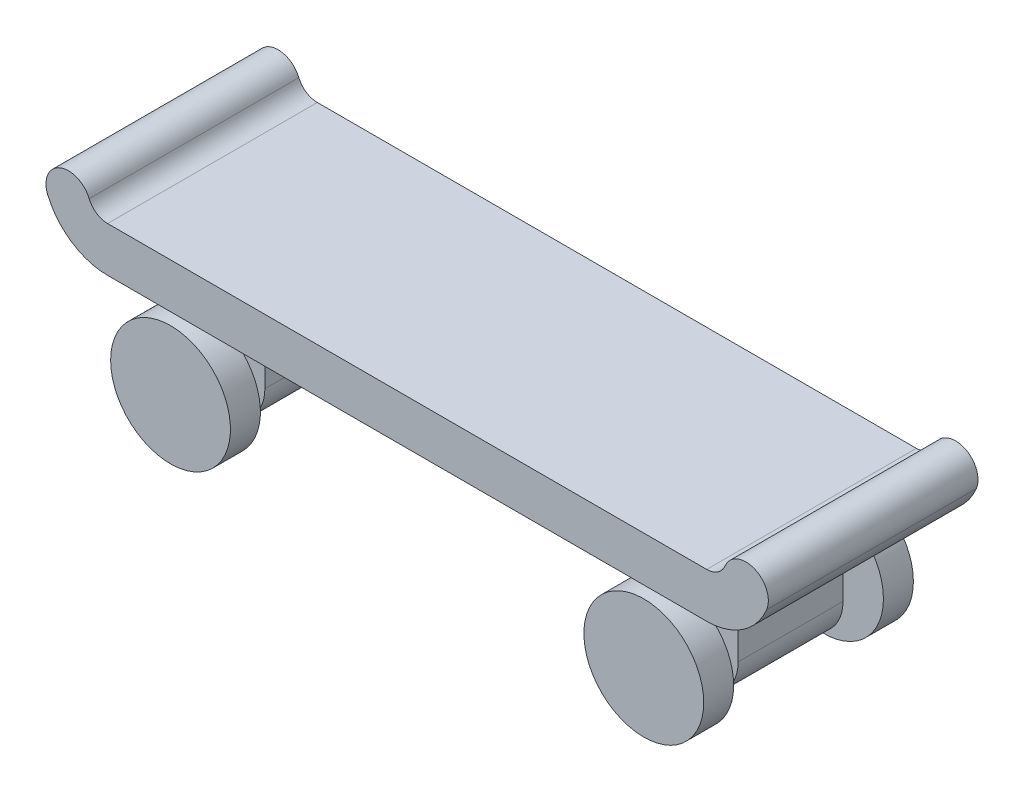
ISO-10303-21;
HEADER;
FILE_DESCRIPTION(('STEP AP214'),'2;1');
FILE_NAME('part.step','',(''),(''),'','','');
FILE_SCHEMA(('AUTOMOTIVE_DESIGN { 1 0 10303 214 1 1 1 1 }'));
ENDSEC;
DATA;
#1=APPLICATION_CONTEXT('core data for automotive mechanical design processes');
#2=APPLICATION_PROTOCOL_DEFINITION('international standard','automotive_design',2000,#1);
#3=PRODUCT_CONTEXT('',#1,'mechanical');
#4=PRODUCT('Part','Part','',(#3));
#5=PRODUCT_RELATED_PRODUCT_CATEGORY('part','',(#4));
#6=PRODUCT_DEFINITION_FORMATION('','',#4);
#7=PRODUCT_DEFINITION_CONTEXT('part definition',#1,'design');
#8=PRODUCT_DEFINITION('design','',#6,#7);
#9=PRODUCT_DEFINITION_SHAPE('','',#8);
#10=(LENGTH_UNIT() NAMED_UNIT(*) SI_UNIT(.MILLI.,.METRE.));
#11=(NAMED_UNIT(*) PLANE_ANGLE_UNIT() SI_UNIT($,.RADIAN.));
#12=(NAMED_UNIT(*) SI_UNIT($,.STERADIAN.) SOLID_ANGLE_UNIT());
#13=UNCERTAINTY_MEASURE_WITH_UNIT(LENGTH_MEASURE(1.E-05),#10,'distance_accuracy_value','');
#14=(GEOMETRIC_REPRESENTATION_CONTEXT(3) GLOBAL_UNCERTAINTY_ASSIGNED_CONTEXT((#13)) GLOBAL_UNIT_ASSIGNED_CONTEXT((#10,
#11,#12)) REPRESENTATION_CONTEXT('',''));
#15=CARTESIAN_POINT('',(0.,0.,0.));
#16=DIRECTION('',(0.,0.,1.));
#17=DIRECTION('',(1.,0.,0.));
#18=AXIS2_PLACEMENT_3D('',#15,#16,#17);
#19=CARTESIAN_POINT('',(-15.8,-4.8,5.));
#20=DIRECTION('',(0.,0.,-1.));
#21=DIRECTION('',(-1.,0.,0.));
#22=AXIS2_PLACEMENT_3D('',#19,#20,#21);
#23=CYLINDRICAL_SURFACE('',#22,1.15);
#24=CARTESIAN_POINT('',(-15.8,-4.8,5.));
#25=DIRECTION('',(0.,0.,1.));
#26=DIRECTION('',(-1.,0.,0.));
#27=AXIS2_PLACEMENT_3D('',#24,#25,#26);
#28=CIRCLE('',#27,1.15);
#29=CARTESIAN_POINT('',(-16.95,-4.8,5.));
#30=VERTEX_POINT('',#29);
#31=EDGE_CURVE('E11',#30,#30,#28,.T.);
#32=ORIENTED_EDGE('',*,*,#31,.F.);
#33=EDGE_LOOP('',(#32));
#34=FACE_BOUND('',#33,.T.);
#35=CARTESIAN_POINT('',(-15.8,-4.8,-5.));
#36=DIRECTION('',(0.,0.,1.));
#37=DIRECTION('',(-1.,0.,0.));
#38=AXIS2_PLACEMENT_3D('',#35,#36,#37);
#39=CIRCLE('',#38,1.15);
#40=CARTESIAN_POINT('',(-16.95,-4.8,-5.));
#41=VERTEX_POINT('',#40);
#42=EDGE_CURVE('E47',#41,#41,#39,.T.);
#43=ORIENTED_EDGE('',*,*,#42,.T.);
#44=EDGE_LOOP('',(#43));
#45=FACE_BOUND('',#44,.T.);
#46=ADVANCED_FACE('F44',(#34,#45),#23,.T.);
#47=CARTESIAN_POINT('',(-15.8,-4.8,7.));
#48=DIRECTION('',(0.,0.,-1.));
#49=DIRECTION('',(-1.,0.,0.));
#50=AXIS2_PLACEMENT_3D('',#47,#48,#49);
#51=CYLINDRICAL_SURFACE('',#50,4.);
#52=CARTESIAN_POINT('',(-15.8,-4.8,7.));
#53=DIRECTION('',(0.,0.,1.));
#54=DIRECTION('',(-1.,0.,0.));
#55=AXIS2_PLACEMENT_3D('',#52,#53,#54);
#56=CIRCLE('',#55,4.);
#57=CARTESIAN_POINT('',(-19.8,-4.8,7.));
#58=VERTEX_POINT('',#57);
#59=EDGE_CURVE('E51',#58,#58,#56,.T.);
#60=ORIENTED_EDGE('',*,*,#59,.F.);
#61=EDGE_LOOP('',(#60));
#62=FACE_BOUND('',#61,.T.);
#63=CARTESIAN_POINT('',(-15.8,-4.8,5.));
#64=DIRECTION('',(0.,0.,1.));
#65=DIRECTION('',(-1.,0.,0.));
#66=AXIS2_PLACEMENT_3D('',#63,#64,#65);
#67=CIRCLE('',#66,4.);
#68=CARTESIAN_POINT('',(-19.8,-4.8,5.));
#69=VERTEX_POINT('',#68);
#70=EDGE_CURVE('E55',#69,#69,#67,.T.);
#71=ORIENTED_EDGE('',*,*,#70,.T.);
#72=EDGE_LOOP('',(#71));
#73=FACE_BOUND('',#72,.T.);
#74=ADVANCED_FACE('F84',(#62,#73),#51,.T.);
#75=CARTESIAN_POINT('',(-15.8,-4.8,7.));
#76=DIRECTION('',(0.,0.,-1.));
#77=DIRECTION('',(-1.,0.,0.));
#78=AXIS2_PLACEMENT_3D('',#75,#76,#77);
#79=PLANE('',#78);
#80=ORIENTED_EDGE('',*,*,#59,.T.);
#81=EDGE_LOOP('',(#80));
#82=FACE_BOUND('',#81,.T.);
#83=ADVANCED_FACE('F89',(#82),#79,.F.);
#84=CARTESIAN_POINT('',(-15.8,-4.8,5.));
#85=DIRECTION('',(0.,0.,-1.));
#86=DIRECTION('',(-1.,0.,0.));
#87=AXIS2_PLACEMENT_3D('',#84,#85,#86);
#88=PLANE('',#87);
#89=ORIENTED_EDGE('',*,*,#31,.T.);
#90=EDGE_LOOP('',(#89));
#91=FACE_BOUND('',#90,.T.);
#92=ORIENTED_EDGE('',*,*,#70,.F.);
#93=EDGE_LOOP('',(#92));
#94=FACE_BOUND('',#93,.T.);
#95=ADVANCED_FACE('F80',(#91,#94),#88,.T.);
#96=CARTESIAN_POINT('',(-15.8,-4.8,-7.));
#97=DIRECTION('',(0.,0.,1.));
#98=DIRECTION('',(-1.,0.,0.));
#99=AXIS2_PLACEMENT_3D('',#96,#97,#98);
#100=PLANE('',#99);
#101=CARTESIAN_POINT('',(-15.8,-4.8,-7.));
#102=DIRECTION('',(0.,0.,1.));
#103=DIRECTION('',(-1.,0.,0.));
#104=AXIS2_PLACEMENT_3D('',#101,#102,#103);
#105=CIRCLE('',#104,4.);
#106=CARTESIAN_POINT('',(-19.8,-4.8,-7.));
#107=VERTEX_POINT('',#106);
#108=EDGE_CURVE('E60',#107,#107,#105,.T.);
#109=ORIENTED_EDGE('',*,*,#108,.F.);
#110=EDGE_LOOP('',(#109));
#111=FACE_BOUND('',#110,.T.);
#112=ADVANCED_FACE('F71',(#111),#100,.F.);
#113=CARTESIAN_POINT('',(-15.8,-4.8,-7.));
#114=DIRECTION('',(0.,0.,1.));
#115=DIRECTION('',(-1.,0.,0.));
#116=AXIS2_PLACEMENT_3D('',#113,#114,#115);
#117=CYLINDRICAL_SURFACE('',#116,4.);
#118=ORIENTED_EDGE('',*,*,#108,.T.);
#119=EDGE_LOOP('',(#118));
#120=FACE_BOUND('',#119,.T.);
#121=CARTESIAN_POINT('',(-15.8,-4.8,-5.));
#122=DIRECTION('',(0.,0.,1.));
#123=DIRECTION('',(-1.,0.,0.));
#124=AXIS2_PLACEMENT_3D('',#121,#122,#123);
#125=CIRCLE('',#124,4.);
#126=CARTESIAN_POINT('',(-19.8,-4.8,-5.));
#127=VERTEX_POINT('',#126);
#128=EDGE_CURVE('E63',#127,#127,#125,.T.);
#129=ORIENTED_EDGE('',*,*,#128,.F.);
#130=EDGE_LOOP('',(#129));
#131=FACE_BOUND('',#130,.T.);
#132=ADVANCED_FACE('F69',(#120,#131),#117,.T.);
#133=CARTESIAN_POINT('',(-15.8,-4.8,-5.));
#134=DIRECTION('',(0.,0.,1.));
#135=DIRECTION('',(-1.,0.,0.));
#136=AXIS2_PLACEMENT_3D('',#133,#134,#135);
#137=PLANE('',#136);
#138=ORIENTED_EDGE('',*,*,#42,.F.);
#139=EDGE_LOOP('',(#138));
#140=FACE_BOUND('',#139,.T.);
#141=ORIENTED_EDGE('',*,*,#128,.T.);
#142=EDGE_LOOP('',(#141));
#143=FACE_BOUND('',#142,.T.);
#144=ADVANCED_FACE('F67',(#140,#143),#137,.T.);
#145=CLOSED_SHELL('',(#46,#74,#83,#95,#112,#132,#144));
#146=MANIFOLD_SOLID_BREP('B2',#145);
#147=CARTESIAN_POINT('',(15.8,-4.8,5.));
#148=DIRECTION('',(0.,0.,-1.));
#149=DIRECTION('',(-1.,0.,0.));
#150=AXIS2_PLACEMENT_3D('',#147,#148,#149);
#151=CYLINDRICAL_SURFACE('',#150,1.15);
#152=CARTESIAN_POINT('',(15.8,-4.8,5.));
#153=DIRECTION('',(0.,0.,1.));
#154=DIRECTION('',(1.,0.,0.));
#155=AXIS2_PLACEMENT_3D('',#152,#153,#154);
#156=CIRCLE('',#155,1.15);
#157=CARTESIAN_POINT('',(16.95,-4.8,5.));
#158=VERTEX_POINT('',#157);
#159=EDGE_CURVE('E43',#158,#158,#156,.T.);
#160=ORIENTED_EDGE('',*,*,#159,.F.);
#161=EDGE_LOOP('',(#160));
#162=FACE_BOUND('',#161,.T.);
#163=CARTESIAN_POINT('',(15.8,-4.8,-5.));
#164=DIRECTION('',(0.,0.,1.));
#165=DIRECTION('',(1.,0.,0.));
#166=AXIS2_PLACEMENT_3D('',#163,#164,#165);
#167=CIRCLE('',#166,1.15);
#168=CARTESIAN_POINT('',(16.95,-4.8,-5.));
#169=VERTEX_POINT('',#168);
#170=EDGE_CURVE('E157',#169,#169,#167,.T.);
#171=ORIENTED_EDGE('',*,*,#170,.T.);
#172=EDGE_LOOP('',(#171));
#173=FACE_BOUND('',#172,.T.);
#174=ADVANCED_FACE('F154',(#162,#173),#151,.T.);
#175=CARTESIAN_POINT('',(15.8,-4.8,7.));
#176=DIRECTION('',(0.,0.,-1.));
#177=DIRECTION('',(-1.,0.,0.));
#178=AXIS2_PLACEMENT_3D('',#175,#176,#177);
#179=CYLINDRICAL_SURFACE('',#178,4.);
#180=CARTESIAN_POINT('',(15.8,-4.8,7.));
#181=DIRECTION('',(0.,0.,1.));
#182=DIRECTION('',(1.,0.,0.));
#183=AXIS2_PLACEMENT_3D('',#180,#181,#182);
#184=CIRCLE('',#183,4.);
#185=CARTESIAN_POINT('',(19.8,-4.8,7.));
#186=VERTEX_POINT('',#185);
#187=EDGE_CURVE('E161',#186,#186,#184,.T.);
#188=ORIENTED_EDGE('',*,*,#187,.F.);
#189=EDGE_LOOP('',(#188));
#190=FACE_BOUND('',#189,.T.);
#191=CARTESIAN_POINT('',(15.8,-4.8,5.));
#192=DIRECTION('',(0.,0.,1.));
#193=DIRECTION('',(1.,0.,0.));
#194=AXIS2_PLACEMENT_3D('',#191,#192,#193);
#195=CIRCLE('',#194,4.);
#196=CARTESIAN_POINT('',(19.8,-4.8,5.));
#197=VERTEX_POINT('',#196);
#198=EDGE_CURVE('E165',#197,#197,#195,.T.);
#199=ORIENTED_EDGE('',*,*,#198,.T.);
#200=EDGE_LOOP('',(#199));
#201=FACE_BOUND('',#200,.T.);
#202=ADVANCED_FACE('F194',(#190,#201),#179,.T.);
#203=CARTESIAN_POINT('',(15.8,-4.8,7.));
#204=DIRECTION('',(0.,0.,1.));
#205=DIRECTION('',(1.,0.,0.));
#206=AXIS2_PLACEMENT_3D('',#203,#204,#205);
#207=PLANE('',#206);
#208=ORIENTED_EDGE('',*,*,#187,.T.);
#209=EDGE_LOOP('',(#208));
#210=FACE_BOUND('',#209,.T.);
#211=ADVANCED_FACE('F199',(#210),#207,.T.);
#212=CARTESIAN_POINT('',(15.8,-4.8,5.));
#213=DIRECTION('',(0.,0.,1.));
#214=DIRECTION('',(1.,0.,0.));
#215=AXIS2_PLACEMENT_3D('',#212,#213,#214);
#216=PLANE('',#215);
#217=ORIENTED_EDGE('',*,*,#159,.T.);
#218=EDGE_LOOP('',(#217));
#219=FACE_BOUND('',#218,.T.);
#220=ORIENTED_EDGE('',*,*,#198,.F.);
#221=EDGE_LOOP('',(#220));
#222=FACE_BOUND('',#221,.T.);
#223=ADVANCED_FACE('F190',(#219,#222),#216,.F.);
#224=CARTESIAN_POINT('',(15.8,-4.8,-7.));
#225=DIRECTION('',(0.,0.,-1.));
#226=DIRECTION('',(1.,0.,0.));
#227=AXIS2_PLACEMENT_3D('',#224,#225,#226);
#228=PLANE('',#227);
#229=CARTESIAN_POINT('',(15.8,-4.8,-7.));
#230=DIRECTION('',(0.,0.,1.));
#231=DIRECTION('',(1.,0.,0.));
#232=AXIS2_PLACEMENT_3D('',#229,#230,#231);
#233=CIRCLE('',#232,4.);
#234=CARTESIAN_POINT('',(19.8,-4.8,-7.));
#235=VERTEX_POINT('',#234);
#236=EDGE_CURVE('E170',#235,#235,#233,.T.);
#237=ORIENTED_EDGE('',*,*,#236,.F.);
#238=EDGE_LOOP('',(#237));
#239=FACE_BOUND('',#238,.T.);
#240=ADVANCED_FACE('F181',(#239),#228,.T.);
#241=CARTESIAN_POINT('',(15.8,-4.8,-7.));
#242=DIRECTION('',(0.,0.,1.));
#243=DIRECTION('',(-1.,0.,0.));
#244=AXIS2_PLACEMENT_3D('',#241,#242,#243);
#245=CYLINDRICAL_SURFACE('',#244,4.);
#246=ORIENTED_EDGE('',*,*,#236,.T.);
#247=EDGE_LOOP('',(#246));
#248=FACE_BOUND('',#247,.T.);
#249=CARTESIAN_POINT('',(15.8,-4.8,-5.));
#250=DIRECTION('',(0.,0.,1.));
#251=DIRECTION('',(1.,0.,0.));
#252=AXIS2_PLACEMENT_3D('',#249,#250,#251);
#253=CIRCLE('',#252,4.);
#254=CARTESIAN_POINT('',(19.8,-4.8,-5.));
#255=VERTEX_POINT('',#254);
#256=EDGE_CURVE('E173',#255,#255,#253,.T.);
#257=ORIENTED_EDGE('',*,*,#256,.F.);
#258=EDGE_LOOP('',(#257));
#259=FACE_BOUND('',#258,.T.);
#260=ADVANCED_FACE('F179',(#248,#259),#245,.T.);
#261=CARTESIAN_POINT('',(15.8,-4.8,-5.));
#262=DIRECTION('',(0.,0.,-1.));
#263=DIRECTION('',(1.,0.,0.));
#264=AXIS2_PLACEMENT_3D('',#261,#262,#263);
#265=PLANE('',#264);
#266=ORIENTED_EDGE('',*,*,#170,.F.);
#267=EDGE_LOOP('',(#266));
#268=FACE_BOUND('',#267,.T.);
#269=ORIENTED_EDGE('',*,*,#256,.T.);
#270=EDGE_LOOP('',(#269));
#271=FACE_BOUND('',#270,.T.);
#272=ADVANCED_FACE('F177',(#268,#271),#265,.F.);
#273=CLOSED_SHELL('',(#174,#202,#211,#223,#240,#260,#272));
#274=MANIFOLD_SOLID_BREP('B6',#273);
#275=CARTESIAN_POINT('',(-20.,0.,7.));
#276=DIRECTION('',(0.,1.,0.));
#277=DIRECTION('',(0.,0.,1.));
#278=AXIS2_PLACEMENT_3D('',#275,#276,#277);
#279=PLANE('',#278);
#280=DIRECTION('',(0.,0.,-1.));
#281=VECTOR('',#280,1.);
#282=CARTESIAN_POINT('',(13.,0.,3.5));
#283=LINE('',#282,#281);
#284=CARTESIAN_POINT('',(13.,0.,3.5));
#285=VERTEX_POINT('',#284);
#286=CARTESIAN_POINT('',(13.,0.,-3.5));
#287=VERTEX_POINT('',#286);
#288=EDGE_CURVE('E426',#285,#287,#283,.T.);
#289=ORIENTED_EDGE('',*,*,#288,.F.);
#290=DIRECTION('',(-1.,0.,0.));
#291=VECTOR('',#290,1.);
#292=CARTESIAN_POINT('',(13.,0.,3.5));
#293=LINE('',#292,#291);
#294=CARTESIAN_POINT('',(18.6,0.,3.5));
#295=VERTEX_POINT('',#294);
#296=EDGE_CURVE('E400',#295,#285,#293,.T.);
#297=ORIENTED_EDGE('',*,*,#296,.F.);
#298=DIRECTION('',(0.,0.,-1.));
#299=VECTOR('',#298,1.);
#300=CARTESIAN_POINT('',(18.6,0.,3.5));
#301=LINE('',#300,#299);
#302=CARTESIAN_POINT('',(18.6,0.,-3.5));
#303=VERTEX_POINT('',#302);
#304=EDGE_CURVE('E411',#295,#303,#301,.T.);
#305=ORIENTED_EDGE('',*,*,#304,.T.);
#306=DIRECTION('',(-1.,0.,0.));
#307=VECTOR('',#306,1.);
#308=CARTESIAN_POINT('',(13.,0.,-3.5));
#309=LINE('',#308,#307);
#310=EDGE_CURVE('E398',#303,#287,#309,.T.);
#311=ORIENTED_EDGE('',*,*,#310,.T.);
#312=EDGE_LOOP('',(#289,#297,#305,#311));
#313=FACE_BOUND('',#312,.T.);
#314=DIRECTION('',(1.,0.,0.));
#315=VECTOR('',#314,1.);
#316=CARTESIAN_POINT('',(-20.,0.,-7.));
#317=LINE('',#316,#315);
#318=CARTESIAN_POINT('',(-20.,0.,-7.));
#319=VERTEX_POINT('',#318);
#320=CARTESIAN_POINT('',(20.,0.,-7.));
#321=VERTEX_POINT('',#320);
#322=EDGE_CURVE('E434',#319,#321,#317,.T.);
#323=ORIENTED_EDGE('',*,*,#322,.T.);
#324=DIRECTION('',(0.,0.,-1.));
#325=VECTOR('',#324,1.);
#326=CARTESIAN_POINT('',(20.,0.,7.));
#327=LINE('',#326,#325);
#328=CARTESIAN_POINT('',(20.,0.,7.));
#329=VERTEX_POINT('',#328);
#330=EDGE_CURVE('E448',#329,#321,#327,.T.);
#331=ORIENTED_EDGE('',*,*,#330,.F.);
#332=DIRECTION('',(1.,0.,0.));
#333=VECTOR('',#332,1.);
#334=CARTESIAN_POINT('',(-20.,0.,7.));
#335=LINE('',#334,#333);
#336=CARTESIAN_POINT('',(-20.,0.,7.));
#337=VERTEX_POINT('',#336);
#338=EDGE_CURVE('E446',#337,#329,#335,.T.);
#339=ORIENTED_EDGE('',*,*,#338,.F.);
#340=DIRECTION('',(0.,0.,-1.));
#341=VECTOR('',#340,1.);
#342=CARTESIAN_POINT('',(-20.,0.,7.));
#343=LINE('',#342,#341);
#344=EDGE_CURVE('E466',#337,#319,#343,.T.);
#345=ORIENTED_EDGE('',*,*,#344,.T.);
#346=EDGE_LOOP('',(#323,#331,#339,#345));
#347=FACE_BOUND('',#346,.T.);
#348=DIRECTION('',(0.,0.,-1.));
#349=VECTOR('',#348,1.);
#350=CARTESIAN_POINT('',(-13.,0.,3.5));
#351=LINE('',#350,#349);
#352=CARTESIAN_POINT('',(-13.,0.,3.5));
#353=VERTEX_POINT('',#352);
#354=CARTESIAN_POINT('',(-13.,0.,-3.5));
#355=VERTEX_POINT('',#354);
#356=EDGE_CURVE('E275',#353,#355,#351,.T.);
#357=ORIENTED_EDGE('',*,*,#356,.T.);
#358=DIRECTION('',(-1.,0.,0.));
#359=VECTOR('',#358,1.);
#360=CARTESIAN_POINT('',(-13.,0.,-3.5));
#361=LINE('',#360,#359);
#362=CARTESIAN_POINT('',(-18.6,0.,-3.5));
#363=VERTEX_POINT('',#362);
#364=EDGE_CURVE('E600',#355,#363,#361,.T.);
#365=ORIENTED_EDGE('',*,*,#364,.T.);
#366=DIRECTION('',(0.,0.,-1.));
#367=VECTOR('',#366,1.);
#368=CARTESIAN_POINT('',(-18.6,0.,3.5));
#369=LINE('',#368,#367);
#370=CARTESIAN_POINT('',(-18.6,0.,3.5));
#371=VERTEX_POINT('',#370);
#372=EDGE_CURVE('E393',#371,#363,#369,.T.);
#373=ORIENTED_EDGE('',*,*,#372,.F.);
#374=DIRECTION('',(-1.,0.,0.));
#375=VECTOR('',#374,1.);
#376=CARTESIAN_POINT('',(-13.,0.,3.5));
#377=LINE('',#376,#375);
#378=EDGE_CURVE('E270',#353,#371,#377,.T.);
#379=ORIENTED_EDGE('',*,*,#378,.F.);
#380=EDGE_LOOP('',(#357,#365,#373,#379));
#381=FACE_BOUND('',#380,.T.);
#382=ADVANCED_FACE('F255',(#313,#347,#381),#279,.F.);
#383=CARTESIAN_POINT('',(20.,4.33333333333333,7.));
#384=DIRECTION('',(0.,0.,-1.));
#385=DIRECTION('',(-1.,0.,0.));
#386=AXIS2_PLACEMENT_3D('',#383,#384,#385);
#387=CYLINDRICAL_SURFACE('',#386,4.33333333333333);
#388=CARTESIAN_POINT('',(20.,4.33333333333333,-7.));
#389=DIRECTION('',(0.,0.,1.));
#390=DIRECTION('',(1.,0.,0.));
#391=AXIS2_PLACEMENT_3D('',#388,#389,#390);
#392=CIRCLE('',#391,4.33333333333333);
#393=CARTESIAN_POINT('',(24.,2.66666666666667,-7.));
#394=VERTEX_POINT('',#393);
#395=EDGE_CURVE('E429',#321,#394,#392,.T.);
#396=ORIENTED_EDGE('',*,*,#395,.T.);
#397=DIRECTION('',(0.,0.,-1.));
#398=VECTOR('',#397,1.);
#399=CARTESIAN_POINT('',(24.,2.66666666666667,7.));
#400=LINE('',#399,#398);
#401=CARTESIAN_POINT('',(24.,2.66666666666667,7.));
#402=VERTEX_POINT('',#401);
#403=EDGE_CURVE('E152',#402,#394,#400,.T.);
#404=ORIENTED_EDGE('',*,*,#403,.F.);
#405=CARTESIAN_POINT('',(20.,4.33333333333333,7.));
#406=DIRECTION('',(0.,0.,1.));
#407=DIRECTION('',(1.,0.,0.));
#408=AXIS2_PLACEMENT_3D('',#405,#406,#407);
#409=CIRCLE('',#408,4.33333333333333);
#410=EDGE_CURVE('E430',#329,#402,#409,.T.);
#411=ORIENTED_EDGE('',*,*,#410,.F.);
#412=ORIENTED_EDGE('',*,*,#330,.T.);
#413=EDGE_LOOP('',(#396,#404,#411,#412));
#414=FACE_BOUND('',#413,.T.);
#415=ADVANCED_FACE('F257',(#414),#387,.T.);
#416=CARTESIAN_POINT('',(22.6153846153846,3.24358974358974,7.));
#417=DIRECTION('',(0.,0.,-1.));
#418=DIRECTION('',(-1.,0.,0.));
#419=AXIS2_PLACEMENT_3D('',#416,#417,#418);
#420=CYLINDRICAL_SURFACE('',#419,1.5);
#421=CARTESIAN_POINT('',(22.6153846153846,3.24358974358974,-7.));
#422=DIRECTION('',(0.,0.,1.));
#423=DIRECTION('',(1.,0.,0.));
#424=AXIS2_PLACEMENT_3D('',#421,#422,#423);
#425=CIRCLE('',#424,1.5);
#426=CARTESIAN_POINT('',(21.2307692307692,3.82051282051282,-7.));
#427=VERTEX_POINT('',#426);
#428=EDGE_CURVE('E451',#394,#427,#425,.T.);
#429=ORIENTED_EDGE('',*,*,#428,.T.);
#430=DIRECTION('',(0.,0.,-1.));
#431=VECTOR('',#430,1.);
#432=CARTESIAN_POINT('',(21.2307692307692,3.82051282051282,7.));
#433=LINE('',#432,#431);
#434=CARTESIAN_POINT('',(21.2307692307692,3.82051282051282,7.));
#435=VERTEX_POINT('',#434);
#436=EDGE_CURVE('E263',#435,#427,#433,.T.);
#437=ORIENTED_EDGE('',*,*,#436,.F.);
#438=CARTESIAN_POINT('',(22.6153846153846,3.24358974358974,7.));
#439=DIRECTION('',(0.,0.,1.));
#440=DIRECTION('',(1.,0.,0.));
#441=AXIS2_PLACEMENT_3D('',#438,#439,#440);
#442=CIRCLE('',#441,1.5);
#443=EDGE_CURVE('E433',#402,#435,#442,.T.);
#444=ORIENTED_EDGE('',*,*,#443,.F.);
#445=ORIENTED_EDGE('',*,*,#403,.T.);
#446=EDGE_LOOP('',(#429,#437,#444,#445));
#447=FACE_BOUND('',#446,.T.);
#448=ADVANCED_FACE('F508',(#447),#420,.T.);
#449=CARTESIAN_POINT('',(20.,4.33333333333333,7.));
#450=DIRECTION('',(0.,0.,-1.));
#451=DIRECTION('',(-1.,0.,0.));
#452=AXIS2_PLACEMENT_3D('',#449,#450,#451);
#453=CYLINDRICAL_SURFACE('',#452,1.33333333333334);
#454=CARTESIAN_POINT('',(20.,4.33333333333333,-7.));
#455=DIRECTION('',(0.,0.,-1.));
#456=DIRECTION('',(1.,0.,0.));
#457=AXIS2_PLACEMENT_3D('',#454,#455,#456);
#458=CIRCLE('',#457,1.33333333333334);
#459=CARTESIAN_POINT('',(20.,3.,-7.));
#460=VERTEX_POINT('',#459);
#461=EDGE_CURVE('E453',#427,#460,#458,.T.);
#462=ORIENTED_EDGE('',*,*,#461,.T.);
#463=DIRECTION('',(0.,0.,-1.));
#464=VECTOR('',#463,1.);
#465=CARTESIAN_POINT('',(20.,3.,7.));
#466=LINE('',#465,#464);
#467=CARTESIAN_POINT('',(20.,3.,7.));
#468=VERTEX_POINT('',#467);
#469=EDGE_CURVE('E478',#468,#460,#466,.T.);
#470=ORIENTED_EDGE('',*,*,#469,.F.);
#471=CARTESIAN_POINT('',(20.,4.33333333333333,7.));
#472=DIRECTION('',(0.,0.,-1.));
#473=DIRECTION('',(1.,0.,0.));
#474=AXIS2_PLACEMENT_3D('',#471,#472,#473);
#475=CIRCLE('',#474,1.33333333333334);
#476=EDGE_CURVE('E436',#435,#468,#475,.T.);
#477=ORIENTED_EDGE('',*,*,#476,.F.);
#478=ORIENTED_EDGE('',*,*,#436,.T.);
#479=EDGE_LOOP('',(#462,#470,#477,#478));
#480=FACE_BOUND('',#479,.T.);
#481=ADVANCED_FACE('F485',(#480),#453,.F.);
#482=CARTESIAN_POINT('',(-20.,3.,7.));
#483=DIRECTION('',(0.,-1.,0.));
#484=DIRECTION('',(1.,0.,0.));
#485=AXIS2_PLACEMENT_3D('',#482,#483,#484);
#486=PLANE('',#485);
#487=DIRECTION('',(-1.,0.,0.));
#488=VECTOR('',#487,1.);
#489=CARTESIAN_POINT('',(-20.,3.,-7.));
#490=LINE('',#489,#488);
#491=CARTESIAN_POINT('',(-20.,3.,-7.));
#492=VERTEX_POINT('',#491);
#493=EDGE_CURVE('E455',#460,#492,#490,.T.);
#494=ORIENTED_EDGE('',*,*,#493,.T.);
#495=DIRECTION('',(0.,0.,-1.));
#496=VECTOR('',#495,1.);
#497=CARTESIAN_POINT('',(-20.,3.,7.));
#498=LINE('',#497,#496);
#499=CARTESIAN_POINT('',(-20.,3.,7.));
#500=VERTEX_POINT('',#499);
#501=EDGE_CURVE('E475',#500,#492,#498,.T.);
#502=ORIENTED_EDGE('',*,*,#501,.F.);
#503=DIRECTION('',(-1.,0.,0.));
#504=VECTOR('',#503,1.);
#505=CARTESIAN_POINT('',(-20.,3.,7.));
#506=LINE('',#505,#504);
#507=EDGE_CURVE('E438',#468,#500,#506,.T.);
#508=ORIENTED_EDGE('',*,*,#507,.F.);
#509=ORIENTED_EDGE('',*,*,#469,.T.);
#510=EDGE_LOOP('',(#494,#502,#508,#509));
#511=FACE_BOUND('',#510,.T.);
#512=ADVANCED_FACE('F496',(#511),#486,.F.);
#513=CARTESIAN_POINT('',(-20.,4.33333333333333,7.));
#514=DIRECTION('',(0.,0.,-1.));
#515=DIRECTION('',(-1.,0.,0.));
#516=AXIS2_PLACEMENT_3D('',#513,#514,#515);
#517=CYLINDRICAL_SURFACE('',#516,1.33333333333333);
#518=CARTESIAN_POINT('',(-20.,4.33333333333333,-7.));
#519=DIRECTION('',(0.,0.,-1.));
#520=DIRECTION('',(-1.,0.,0.));
#521=AXIS2_PLACEMENT_3D('',#518,#519,#520);
#522=CIRCLE('',#521,1.33333333333333);
#523=CARTESIAN_POINT('',(-21.2307692307692,3.82051282051282,-7.));
#524=VERTEX_POINT('',#523);
#525=EDGE_CURVE('E457',#492,#524,#522,.T.);
#526=ORIENTED_EDGE('',*,*,#525,.T.);
#527=DIRECTION('',(0.,0.,-1.));
#528=VECTOR('',#527,1.);
#529=CARTESIAN_POINT('',(-21.2307692307692,3.82051282051282,7.));
#530=LINE('',#529,#528);
#531=CARTESIAN_POINT('',(-21.2307692307692,3.82051282051282,7.));
#532=VERTEX_POINT('',#531);
#533=EDGE_CURVE('E472',#532,#524,#530,.T.);
#534=ORIENTED_EDGE('',*,*,#533,.F.);
#535=CARTESIAN_POINT('',(-20.,4.33333333333333,7.));
#536=DIRECTION('',(0.,0.,-1.));
#537=DIRECTION('',(-1.,0.,0.));
#538=AXIS2_PLACEMENT_3D('',#535,#536,#537);
#539=CIRCLE('',#538,1.33333333333333);
#540=EDGE_CURVE('E440',#500,#532,#539,.T.);
#541=ORIENTED_EDGE('',*,*,#540,.F.);
#542=ORIENTED_EDGE('',*,*,#501,.T.);
#543=EDGE_LOOP('',(#526,#534,#541,#542));
#544=FACE_BOUND('',#543,.T.);
#545=ADVANCED_FACE('F500',(#544),#517,.F.);
#546=CARTESIAN_POINT('',(-22.6153846153846,3.24358974358974,7.));
#547=DIRECTION('',(0.,0.,-1.));
#548=DIRECTION('',(-1.,0.,0.));
#549=AXIS2_PLACEMENT_3D('',#546,#547,#548);
#550=CYLINDRICAL_SURFACE('',#549,1.5);
#551=CARTESIAN_POINT('',(-22.6153846153846,3.24358974358974,-7.));
#552=DIRECTION('',(0.,0.,1.));
#553=DIRECTION('',(-1.,0.,0.));
#554=AXIS2_PLACEMENT_3D('',#551,#552,#553);
#555=CIRCLE('',#554,1.5);
#556=CARTESIAN_POINT('',(-24.,2.66666666666666,-7.));
#557=VERTEX_POINT('',#556);
#558=EDGE_CURVE('E459',#524,#557,#555,.T.);
#559=ORIENTED_EDGE('',*,*,#558,.T.);
#560=DIRECTION('',(0.,0.,-1.));
#561=VECTOR('',#560,1.);
#562=CARTESIAN_POINT('',(-24.,2.66666666666666,7.));
#563=LINE('',#562,#561);
#564=CARTESIAN_POINT('',(-24.,2.66666666666666,7.));
#565=VERTEX_POINT('',#564);
#566=EDGE_CURVE('E469',#565,#557,#563,.T.);
#567=ORIENTED_EDGE('',*,*,#566,.F.);
#568=CARTESIAN_POINT('',(-22.6153846153846,3.24358974358974,7.));
#569=DIRECTION('',(0.,0.,1.));
#570=DIRECTION('',(-1.,0.,0.));
#571=AXIS2_PLACEMENT_3D('',#568,#569,#570);
#572=CIRCLE('',#571,1.5);
#573=EDGE_CURVE('E442',#532,#565,#572,.T.);
#574=ORIENTED_EDGE('',*,*,#573,.F.);
#575=ORIENTED_EDGE('',*,*,#533,.T.);
#576=EDGE_LOOP('',(#559,#567,#574,#575));
#577=FACE_BOUND('',#576,.T.);
#578=ADVANCED_FACE('F520',(#577),#550,.T.);
#579=CARTESIAN_POINT('',(-20.,4.33333333333333,7.));
#580=DIRECTION('',(0.,0.,-1.));
#581=DIRECTION('',(-1.,0.,0.));
#582=AXIS2_PLACEMENT_3D('',#579,#580,#581);
#583=CYLINDRICAL_SURFACE('',#582,4.33333333333333);
#584=CARTESIAN_POINT('',(-20.,4.33333333333333,-7.));
#585=DIRECTION('',(0.,0.,1.));
#586=DIRECTION('',(-1.,0.,0.));
#587=AXIS2_PLACEMENT_3D('',#584,#585,#586);
#588=CIRCLE('',#587,4.33333333333333);
#589=EDGE_CURVE('E461',#557,#319,#588,.T.);
#590=ORIENTED_EDGE('',*,*,#589,.T.);
#591=ORIENTED_EDGE('',*,*,#344,.F.);
#592=CARTESIAN_POINT('',(-20.,4.33333333333333,7.));
#593=DIRECTION('',(0.,0.,1.));
#594=DIRECTION('',(-1.,0.,0.));
#595=AXIS2_PLACEMENT_3D('',#592,#593,#594);
#596=CIRCLE('',#595,4.33333333333333);
#597=EDGE_CURVE('E444',#565,#337,#596,.T.);
#598=ORIENTED_EDGE('',*,*,#597,.F.);
#599=ORIENTED_EDGE('',*,*,#566,.T.);
#600=EDGE_LOOP('',(#590,#591,#598,#599));
#601=FACE_BOUND('',#600,.T.);
#602=ADVANCED_FACE('F518',(#601),#583,.T.);
#603=CARTESIAN_POINT('',(20.,4.33333333333333,7.));
#604=DIRECTION('',(0.,0.,1.));
#605=DIRECTION('',(1.,0.,0.));
#606=AXIS2_PLACEMENT_3D('',#603,#604,#605);
#607=PLANE('',#606);
#608=ORIENTED_EDGE('',*,*,#410,.T.);
#609=ORIENTED_EDGE('',*,*,#443,.T.);
#610=ORIENTED_EDGE('',*,*,#476,.T.);
#611=ORIENTED_EDGE('',*,*,#507,.T.);
#612=ORIENTED_EDGE('',*,*,#540,.T.);
#613=ORIENTED_EDGE('',*,*,#573,.T.);
#614=ORIENTED_EDGE('',*,*,#597,.T.);
#615=ORIENTED_EDGE('',*,*,#338,.T.);
#616=EDGE_LOOP('',(#608,#609,#610,#611,#612,#613,#614,#615));
#617=FACE_BOUND('',#616,.T.);
#618=ADVANCED_FACE('F504',(#617),#607,.T.);
#619=CARTESIAN_POINT('',(20.,4.33333333333333,-7.));
#620=DIRECTION('',(0.,0.,1.));
#621=DIRECTION('',(1.,0.,0.));
#622=AXIS2_PLACEMENT_3D('',#619,#620,#621);
#623=PLANE('',#622);
#624=ORIENTED_EDGE('',*,*,#395,.F.);
#625=ORIENTED_EDGE('',*,*,#322,.F.);
#626=ORIENTED_EDGE('',*,*,#589,.F.);
#627=ORIENTED_EDGE('',*,*,#558,.F.);
#628=ORIENTED_EDGE('',*,*,#525,.F.);
#629=ORIENTED_EDGE('',*,*,#493,.F.);
#630=ORIENTED_EDGE('',*,*,#461,.F.);
#631=ORIENTED_EDGE('',*,*,#428,.F.);
#632=EDGE_LOOP('',(#624,#625,#626,#627,#628,#629,#630,#631));
#633=FACE_BOUND('',#632,.T.);
#634=ADVANCED_FACE('F491',(#633),#623,.F.);
#635=CARTESIAN_POINT('',(15.8,-4.8,3.5));
#636=DIRECTION('',(0.,0.,-1.));
#637=DIRECTION('',(-1.,0.,0.));
#638=AXIS2_PLACEMENT_3D('',#635,#636,#637);
#639=PLANE('',#638);
#640=ORIENTED_EDGE('',*,*,#296,.T.);
#641=DIRECTION('',(0.,-1.,0.));
#642=VECTOR('',#641,1.);
#643=CARTESIAN_POINT('',(13.,-4.8,3.5));
#644=LINE('',#643,#642);
#645=CARTESIAN_POINT('',(13.,-4.8,3.5));
#646=VERTEX_POINT('',#645);
#647=EDGE_CURVE('E403',#285,#646,#644,.T.);
#648=ORIENTED_EDGE('',*,*,#647,.T.);
#649=CARTESIAN_POINT('',(15.8,-4.8,3.5));
#650=DIRECTION('',(0.,0.,1.));
#651=DIRECTION('',(-1.,0.,0.));
#652=AXIS2_PLACEMENT_3D('',#649,#650,#651);
#653=CIRCLE('',#652,2.8);
#654=CARTESIAN_POINT('',(18.6,-4.8,3.5));
#655=VERTEX_POINT('',#654);
#656=EDGE_CURVE('E406',#646,#655,#653,.T.);
#657=ORIENTED_EDGE('',*,*,#656,.T.);
#658=DIRECTION('',(0.,1.,0.));
#659=VECTOR('',#658,1.);
#660=CARTESIAN_POINT('',(18.6,0.,3.5));
#661=LINE('',#660,#659);
#662=EDGE_CURVE('E408',#655,#295,#661,.T.);
#663=ORIENTED_EDGE('',*,*,#662,.T.);
#664=EDGE_LOOP('',(#640,#648,#657,#663));
#665=FACE_BOUND('',#664,.T.);
#666=CARTESIAN_POINT('',(15.8,-4.8,3.5));
#667=DIRECTION('',(0.,0.,1.));
#668=DIRECTION('',(1.,0.,0.));
#669=AXIS2_PLACEMENT_3D('',#666,#667,#668);
#670=CIRCLE('',#669,1.75);
#671=CARTESIAN_POINT('',(17.55,-4.8,3.5));
#672=VERTEX_POINT('',#671);
#673=EDGE_CURVE('E391',#672,#672,#670,.T.);
#674=ORIENTED_EDGE('',*,*,#673,.F.);
#675=EDGE_LOOP('',(#674));
#676=FACE_BOUND('',#675,.T.);
#677=ADVANCED_FACE('F538',(#665,#676),#639,.F.);
#678=CARTESIAN_POINT('',(15.8,-4.8,-3.5));
#679=DIRECTION('',(0.,0.,-1.));
#680=DIRECTION('',(-1.,0.,0.));
#681=AXIS2_PLACEMENT_3D('',#678,#679,#680);
#682=PLANE('',#681);
#683=ORIENTED_EDGE('',*,*,#310,.F.);
#684=DIRECTION('',(0.,1.,0.));
#685=VECTOR('',#684,1.);
#686=CARTESIAN_POINT('',(18.6,0.,-3.5));
#687=LINE('',#686,#685);
#688=CARTESIAN_POINT('',(18.6,-4.8,-3.5));
#689=VERTEX_POINT('',#688);
#690=EDGE_CURVE('E404',#689,#303,#687,.T.);
#691=ORIENTED_EDGE('',*,*,#690,.F.);
#692=CARTESIAN_POINT('',(15.8,-4.8,-3.5));
#693=DIRECTION('',(0.,0.,1.));
#694=DIRECTION('',(-1.,0.,0.));
#695=AXIS2_PLACEMENT_3D('',#692,#693,#694);
#696=CIRCLE('',#695,2.8);
#697=CARTESIAN_POINT('',(13.,-4.8,-3.5));
#698=VERTEX_POINT('',#697);
#699=EDGE_CURVE('E415',#698,#689,#696,.T.);
#700=ORIENTED_EDGE('',*,*,#699,.F.);
#701=DIRECTION('',(0.,-1.,0.));
#702=VECTOR('',#701,1.);
#703=CARTESIAN_POINT('',(13.,-4.8,-3.5));
#704=LINE('',#703,#702);
#705=EDGE_CURVE('E413',#287,#698,#704,.T.);
#706=ORIENTED_EDGE('',*,*,#705,.F.);
#707=EDGE_LOOP('',(#683,#691,#700,#706));
#708=FACE_BOUND('',#707,.T.);
#709=CARTESIAN_POINT('',(15.8,-4.8,-3.5));
#710=DIRECTION('',(0.,0.,1.));
#711=DIRECTION('',(1.,0.,0.));
#712=AXIS2_PLACEMENT_3D('',#709,#710,#711);
#713=CIRCLE('',#712,1.75);
#714=CARTESIAN_POINT('',(17.55,-4.8,-3.5));
#715=VERTEX_POINT('',#714);
#716=EDGE_CURVE('E388',#715,#715,#713,.T.);
#717=ORIENTED_EDGE('',*,*,#716,.T.);
#718=EDGE_LOOP('',(#717));
#719=FACE_BOUND('',#718,.T.);
#720=ADVANCED_FACE('F545',(#708,#719),#682,.T.);
#721=CARTESIAN_POINT('',(13.,-4.8,3.5));
#722=DIRECTION('',(1.,0.,0.));
#723=DIRECTION('',(0.,0.,-1.));
#724=AXIS2_PLACEMENT_3D('',#721,#722,#723);
#725=PLANE('',#724);
#726=ORIENTED_EDGE('',*,*,#705,.T.);
#727=DIRECTION('',(0.,0.,-1.));
#728=VECTOR('',#727,1.);
#729=CARTESIAN_POINT('',(13.,-4.8,3.5));
#730=LINE('',#729,#728);
#731=EDGE_CURVE('E423',#646,#698,#730,.T.);
#732=ORIENTED_EDGE('',*,*,#731,.F.);
#733=ORIENTED_EDGE('',*,*,#647,.F.);
#734=ORIENTED_EDGE('',*,*,#288,.T.);
#735=EDGE_LOOP('',(#726,#732,#733,#734));
#736=FACE_BOUND('',#735,.T.);
#737=ADVANCED_FACE('F541',(#736),#725,.F.);
#738=CARTESIAN_POINT('',(15.8,-4.8,3.5));
#739=DIRECTION('',(0.,0.,-1.));
#740=DIRECTION('',(-1.,0.,0.));
#741=AXIS2_PLACEMENT_3D('',#738,#739,#740);
#742=CYLINDRICAL_SURFACE('',#741,2.8);
#743=ORIENTED_EDGE('',*,*,#699,.T.);
#744=DIRECTION('',(0.,0.,-1.));
#745=VECTOR('',#744,1.);
#746=CARTESIAN_POINT('',(18.6,-4.8,3.5));
#747=LINE('',#746,#745);
#748=EDGE_CURVE('E420',#655,#689,#747,.T.);
#749=ORIENTED_EDGE('',*,*,#748,.F.);
#750=ORIENTED_EDGE('',*,*,#656,.F.);
#751=ORIENTED_EDGE('',*,*,#731,.T.);
#752=EDGE_LOOP('',(#743,#749,#750,#751));
#753=FACE_BOUND('',#752,.T.);
#754=ADVANCED_FACE('F544',(#753),#742,.T.);
#755=CARTESIAN_POINT('',(18.6,0.,3.5));
#756=DIRECTION('',(-1.,0.,0.));
#757=DIRECTION('',(0.,0.,1.));
#758=AXIS2_PLACEMENT_3D('',#755,#756,#757);
#759=PLANE('',#758);
#760=ORIENTED_EDGE('',*,*,#690,.T.);
#761=ORIENTED_EDGE('',*,*,#304,.F.);
#762=ORIENTED_EDGE('',*,*,#662,.F.);
#763=ORIENTED_EDGE('',*,*,#748,.T.);
#764=EDGE_LOOP('',(#760,#761,#762,#763));
#765=FACE_BOUND('',#764,.T.);
#766=ADVANCED_FACE('F549',(#765),#759,.F.);
#767=CARTESIAN_POINT('',(15.8,-4.8,3.5));
#768=DIRECTION('',(0.,0.,-1.));
#769=DIRECTION('',(-1.,0.,0.));
#770=AXIS2_PLACEMENT_3D('',#767,#768,#769);
#771=CYLINDRICAL_SURFACE('',#770,1.75);
#772=ORIENTED_EDGE('',*,*,#673,.T.);
#773=EDGE_LOOP('',(#772));
#774=FACE_BOUND('',#773,.T.);
#775=ORIENTED_EDGE('',*,*,#716,.F.);
#776=EDGE_LOOP('',(#775));
#777=FACE_BOUND('',#776,.T.);
#778=ADVANCED_FACE('F553',(#774,#777),#771,.F.);
#779=CARTESIAN_POINT('',(-15.8,-4.8,3.5));
#780=DIRECTION('',(0.,0.,1.));
#781=DIRECTION('',(1.,0.,0.));
#782=AXIS2_PLACEMENT_3D('',#779,#780,#781);
#783=PLANE('',#782);
#784=CARTESIAN_POINT('',(-15.8,-4.8,3.5));
#785=DIRECTION('',(0.,0.,1.));
#786=DIRECTION('',(1.,0.,0.));
#787=AXIS2_PLACEMENT_3D('',#784,#785,#786);
#788=CIRCLE('',#787,2.8);
#789=CARTESIAN_POINT('',(-18.6,-4.8,3.5));
#790=VERTEX_POINT('',#789);
#791=CARTESIAN_POINT('',(-13.,-4.8,3.5));
#792=VERTEX_POINT('',#791);
#793=EDGE_CURVE('E373',#790,#792,#788,.T.);
#794=ORIENTED_EDGE('',*,*,#793,.T.);
#795=DIRECTION('',(0.,1.,0.));
#796=VECTOR('',#795,1.);
#797=CARTESIAN_POINT('',(-13.,-4.8,3.5));
#798=LINE('',#797,#796);
#799=EDGE_CURVE('E366',#792,#353,#798,.T.);
#800=ORIENTED_EDGE('',*,*,#799,.T.);
#801=ORIENTED_EDGE('',*,*,#378,.T.);
#802=DIRECTION('',(0.,-1.,0.));
#803=VECTOR('',#802,1.);
#804=CARTESIAN_POINT('',(-18.6,0.,3.5));
#805=LINE('',#804,#803);
#806=EDGE_CURVE('E379',#371,#790,#805,.T.);
#807=ORIENTED_EDGE('',*,*,#806,.T.);
#808=EDGE_LOOP('',(#794,#800,#801,#807));
#809=FACE_BOUND('',#808,.T.);
#810=CARTESIAN_POINT('',(-15.8,-4.8,3.5));
#811=DIRECTION('',(0.,0.,1.));
#812=DIRECTION('',(-1.,0.,0.));
#813=AXIS2_PLACEMENT_3D('',#810,#811,#812);
#814=CIRCLE('',#813,1.75);
#815=CARTESIAN_POINT('',(-17.55,-4.8,3.5));
#816=VERTEX_POINT('',#815);
#817=EDGE_CURVE('E586',#816,#816,#814,.T.);
#818=ORIENTED_EDGE('',*,*,#817,.F.);
#819=EDGE_LOOP('',(#818));
#820=FACE_BOUND('',#819,.T.);
#821=ADVANCED_FACE('F376',(#809,#820),#783,.T.);
#822=CARTESIAN_POINT('',(-15.8,-4.8,-3.5));
#823=DIRECTION('',(0.,0.,1.));
#824=DIRECTION('',(1.,0.,0.));
#825=AXIS2_PLACEMENT_3D('',#822,#823,#824);
#826=PLANE('',#825);
#827=CARTESIAN_POINT('',(-15.8,-4.8,-3.5));
#828=DIRECTION('',(0.,0.,1.));
#829=DIRECTION('',(1.,0.,0.));
#830=AXIS2_PLACEMENT_3D('',#827,#828,#829);
#831=CIRCLE('',#830,2.8);
#832=CARTESIAN_POINT('',(-18.6,-4.8,-3.5));
#833=VERTEX_POINT('',#832);
#834=CARTESIAN_POINT('',(-13.,-4.8,-3.5));
#835=VERTEX_POINT('',#834);
#836=EDGE_CURVE('E387',#833,#835,#831,.T.);
#837=ORIENTED_EDGE('',*,*,#836,.F.);
#838=DIRECTION('',(0.,-1.,0.));
#839=VECTOR('',#838,1.);
#840=CARTESIAN_POINT('',(-18.6,0.,-3.5));
#841=LINE('',#840,#839);
#842=EDGE_CURVE('E383',#363,#833,#841,.T.);
#843=ORIENTED_EDGE('',*,*,#842,.F.);
#844=ORIENTED_EDGE('',*,*,#364,.F.);
#845=DIRECTION('',(0.,1.,0.));
#846=VECTOR('',#845,1.);
#847=CARTESIAN_POINT('',(-13.,-4.8,-3.5));
#848=LINE('',#847,#846);
#849=EDGE_CURVE('E598',#835,#355,#848,.T.);
#850=ORIENTED_EDGE('',*,*,#849,.F.);
#851=EDGE_LOOP('',(#837,#843,#844,#850));
#852=FACE_BOUND('',#851,.T.);
#853=CARTESIAN_POINT('',(-15.8,-4.8,-3.5));
#854=DIRECTION('',(0.,0.,1.));
#855=DIRECTION('',(-1.,0.,0.));
#856=AXIS2_PLACEMENT_3D('',#853,#854,#855);
#857=CIRCLE('',#856,1.75);
#858=CARTESIAN_POINT('',(-17.55,-4.8,-3.5));
#859=VERTEX_POINT('',#858);
#860=EDGE_CURVE('E589',#859,#859,#857,.T.);
#861=ORIENTED_EDGE('',*,*,#860,.T.);
#862=EDGE_LOOP('',(#861));
#863=FACE_BOUND('',#862,.T.);
#864=ADVANCED_FACE('F566',(#852,#863),#826,.F.);
#865=CARTESIAN_POINT('',(-15.8,-4.8,3.5));
#866=DIRECTION('',(0.,0.,-1.));
#867=DIRECTION('',(-1.,0.,0.));
#868=AXIS2_PLACEMENT_3D('',#865,#866,#867);
#869=CYLINDRICAL_SURFACE('',#868,2.8);
#870=ORIENTED_EDGE('',*,*,#836,.T.);
#871=DIRECTION('',(0.,0.,-1.));
#872=VECTOR('',#871,1.);
#873=CARTESIAN_POINT('',(-13.,-4.8,3.5));
#874=LINE('',#873,#872);
#875=EDGE_CURVE('E370',#792,#835,#874,.T.);
#876=ORIENTED_EDGE('',*,*,#875,.F.);
#877=ORIENTED_EDGE('',*,*,#793,.F.);
#878=DIRECTION('',(0.,0.,-1.));
#879=VECTOR('',#878,1.);
#880=CARTESIAN_POINT('',(-18.6,-4.8,3.5));
#881=LINE('',#880,#879);
#882=EDGE_CURVE('E596',#790,#833,#881,.T.);
#883=ORIENTED_EDGE('',*,*,#882,.T.);
#884=EDGE_LOOP('',(#870,#876,#877,#883));
#885=FACE_BOUND('',#884,.T.);
#886=ADVANCED_FACE('F385',(#885),#869,.T.);
#887=CARTESIAN_POINT('',(-13.,-4.8,3.5));
#888=DIRECTION('',(-1.,0.,0.));
#889=DIRECTION('',(0.,0.,1.));
#890=AXIS2_PLACEMENT_3D('',#887,#888,#889);
#891=PLANE('',#890);
#892=ORIENTED_EDGE('',*,*,#849,.T.);
#893=ORIENTED_EDGE('',*,*,#356,.F.);
#894=ORIENTED_EDGE('',*,*,#799,.F.);
#895=ORIENTED_EDGE('',*,*,#875,.T.);
#896=EDGE_LOOP('',(#892,#893,#894,#895));
#897=FACE_BOUND('',#896,.T.);
#898=ADVANCED_FACE('F368',(#897),#891,.F.);
#899=CARTESIAN_POINT('',(-18.6,0.,3.5));
#900=DIRECTION('',(1.,0.,0.));
#901=DIRECTION('',(0.,0.,-1.));
#902=AXIS2_PLACEMENT_3D('',#899,#900,#901);
#903=PLANE('',#902);
#904=ORIENTED_EDGE('',*,*,#842,.T.);
#905=ORIENTED_EDGE('',*,*,#882,.F.);
#906=ORIENTED_EDGE('',*,*,#806,.F.);
#907=ORIENTED_EDGE('',*,*,#372,.T.);
#908=EDGE_LOOP('',(#904,#905,#906,#907));
#909=FACE_BOUND('',#908,.T.);
#910=ADVANCED_FACE('F569',(#909),#903,.F.);
#911=CARTESIAN_POINT('',(-15.8,-4.8,3.5));
#912=DIRECTION('',(0.,0.,-1.));
#913=DIRECTION('',(-1.,0.,0.));
#914=AXIS2_PLACEMENT_3D('',#911,#912,#913);
#915=CYLINDRICAL_SURFACE('',#914,1.75);
#916=ORIENTED_EDGE('',*,*,#817,.T.);
#917=EDGE_LOOP('',(#916));
#918=FACE_BOUND('',#917,.T.);
#919=ORIENTED_EDGE('',*,*,#860,.F.);
#920=EDGE_LOOP('',(#919));
#921=FACE_BOUND('',#920,.T.);
#922=ADVANCED_FACE('F572',(#918,#921),#915,.F.);
#923=CLOSED_SHELL('',(#382,#415,#448,#481,#512,#545,#578,#602,#618,#634,#677,#720,#737,#754,
#766,#778,#821,#864,#886,#898,#910,#922));
#924=MANIFOLD_SOLID_BREP('B38',#923);
#925=ADVANCED_BREP_SHAPE_REPRESENTATION('',(#18,#146,#274,#924),#14);
#926=SHAPE_DEFINITION_REPRESENTATION(#9,#925);
ENDSEC;
END-ISO-10303-21;
